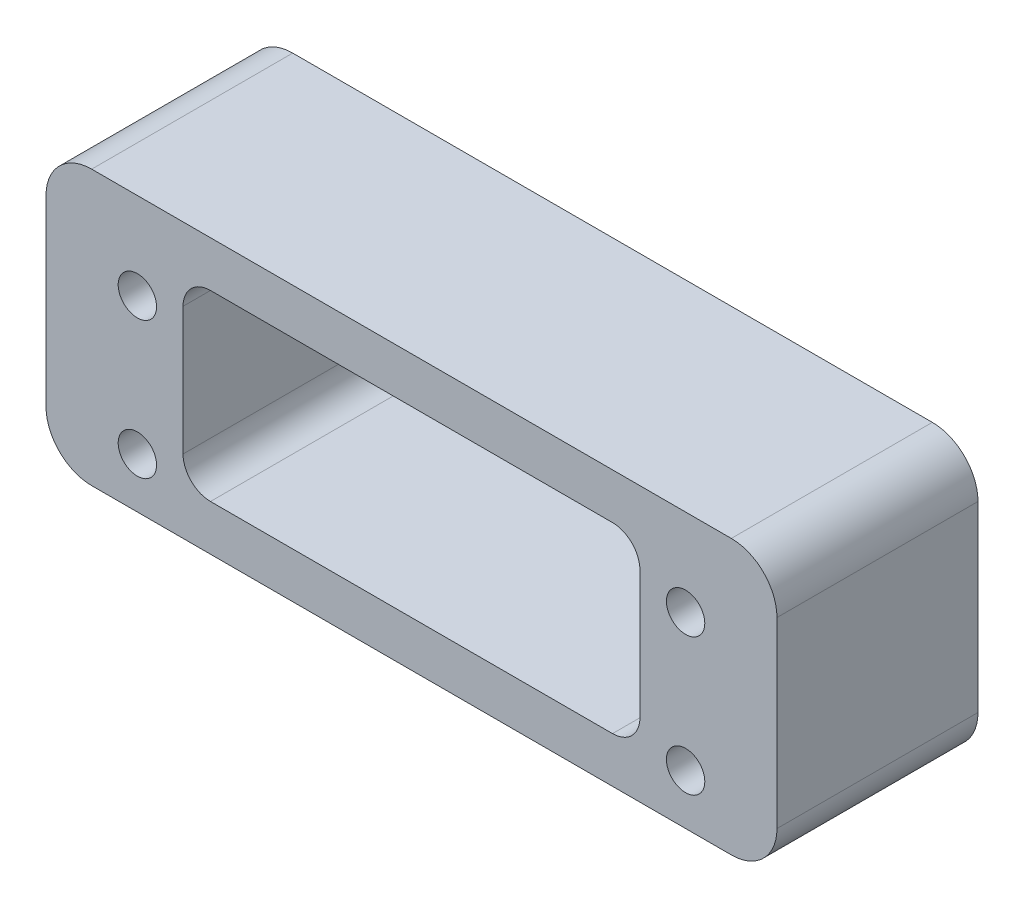
ISO-10303-21;
HEADER;
FILE_DESCRIPTION(('STEP AP214'),'2;1');
FILE_NAME('part.step','',(''),(''),'','','');
FILE_SCHEMA(('AUTOMOTIVE_DESIGN { 1 0 10303 214 1 1 1 1 }'));
ENDSEC;
DATA;
#1=APPLICATION_CONTEXT('core data for automotive mechanical design processes');
#2=APPLICATION_PROTOCOL_DEFINITION('international standard','automotive_design',2000,#1);
#3=PRODUCT_CONTEXT('',#1,'mechanical');
#4=PRODUCT('Part','Part','',(#3));
#5=PRODUCT_RELATED_PRODUCT_CATEGORY('part','',(#4));
#6=PRODUCT_DEFINITION_FORMATION('','',#4);
#7=PRODUCT_DEFINITION_CONTEXT('part definition',#1,'design');
#8=PRODUCT_DEFINITION('design','',#6,#7);
#9=PRODUCT_DEFINITION_SHAPE('','',#8);
#10=(LENGTH_UNIT() NAMED_UNIT(*) SI_UNIT(.MILLI.,.METRE.));
#11=(NAMED_UNIT(*) PLANE_ANGLE_UNIT() SI_UNIT($,.RADIAN.));
#12=(NAMED_UNIT(*) SI_UNIT($,.STERADIAN.) SOLID_ANGLE_UNIT());
#13=UNCERTAINTY_MEASURE_WITH_UNIT(LENGTH_MEASURE(1.E-05),#10,'distance_accuracy_value','');
#14=(GEOMETRIC_REPRESENTATION_CONTEXT(3) GLOBAL_UNCERTAINTY_ASSIGNED_CONTEXT((#13)) GLOBAL_UNIT_ASSIGNED_CONTEXT((#10,
#11,#12)) REPRESENTATION_CONTEXT('',''));
#15=CARTESIAN_POINT('',(0.,0.,0.));
#16=DIRECTION('',(0.,0.,1.));
#17=DIRECTION('',(1.,0.,0.));
#18=AXIS2_PLACEMENT_3D('',#15,#16,#17);
#19=CARTESIAN_POINT('',(40.,15.,11.));
#20=DIRECTION('',(-1.,0.,0.));
#21=DIRECTION('',(0.,-1.,0.));
#22=AXIS2_PLACEMENT_3D('',#19,#20,#21);
#23=PLANE('',#22);
#24=DIRECTION('',(0.,1.,0.));
#25=VECTOR('',#24,1.);
#26=CARTESIAN_POINT('',(40.,15.,11.));
#27=LINE('',#26,#25);
#28=CARTESIAN_POINT('',(40.,-10.,11.));
#29=VERTEX_POINT('',#28);
#30=CARTESIAN_POINT('',(40.,9.99999999999999,11.));
#31=VERTEX_POINT('',#30);
#32=EDGE_CURVE('E166',#29,#31,#27,.T.);
#33=ORIENTED_EDGE('',*,*,#32,.F.);
#34=DIRECTION('',(0.,0.,-1.));
#35=VECTOR('',#34,1.);
#36=CARTESIAN_POINT('',(40.,-10.,11.));
#37=LINE('',#36,#35);
#38=CARTESIAN_POINT('',(40.,-10.,-11.));
#39=VERTEX_POINT('',#38);
#40=EDGE_CURVE('E151',#29,#39,#37,.T.);
#41=ORIENTED_EDGE('',*,*,#40,.T.);
#42=DIRECTION('',(0.,1.,0.));
#43=VECTOR('',#42,1.);
#44=CARTESIAN_POINT('',(40.,15.,-11.));
#45=LINE('',#44,#43);
#46=CARTESIAN_POINT('',(40.,9.99999999999999,-11.));
#47=VERTEX_POINT('',#46);
#48=EDGE_CURVE('E163',#39,#47,#45,.T.);
#49=ORIENTED_EDGE('',*,*,#48,.T.);
#50=DIRECTION('',(0.,0.,-1.));
#51=VECTOR('',#50,1.);
#52=CARTESIAN_POINT('',(40.,9.99999999999999,11.));
#53=LINE('',#52,#51);
#54=EDGE_CURVE('E168',#47,#31,#53,.F.);
#55=ORIENTED_EDGE('',*,*,#54,.T.);
#56=EDGE_LOOP('',(#33,#41,#49,#55));
#57=FACE_BOUND('',#56,.T.);
#58=ADVANCED_FACE('F34',(#57),#23,.F.);
#59=CARTESIAN_POINT('',(-40.,15.,11.));
#60=DIRECTION('',(0.,-1.,0.));
#61=DIRECTION('',(1.,0.,0.));
#62=AXIS2_PLACEMENT_3D('',#59,#60,#61);
#63=PLANE('',#62);
#64=DIRECTION('',(-1.,0.,0.));
#65=VECTOR('',#64,1.);
#66=CARTESIAN_POINT('',(-40.,15.,-11.));
#67=LINE('',#66,#65);
#68=CARTESIAN_POINT('',(35.,15.,-11.));
#69=VERTEX_POINT('',#68);
#70=CARTESIAN_POINT('',(-35.,15.,-11.));
#71=VERTEX_POINT('',#70);
#72=EDGE_CURVE('E172',#69,#71,#67,.T.);
#73=ORIENTED_EDGE('',*,*,#72,.T.);
#74=DIRECTION('',(0.,0.,-1.));
#75=VECTOR('',#74,1.);
#76=CARTESIAN_POINT('',(-35.,15.,11.));
#77=LINE('',#76,#75);
#78=CARTESIAN_POINT('',(-35.,15.,11.));
#79=VERTEX_POINT('',#78);
#80=EDGE_CURVE('E213',#71,#79,#77,.F.);
#81=ORIENTED_EDGE('',*,*,#80,.T.);
#82=DIRECTION('',(-1.,0.,0.));
#83=VECTOR('',#82,1.);
#84=CARTESIAN_POINT('',(-40.,15.,11.));
#85=LINE('',#84,#83);
#86=CARTESIAN_POINT('',(35.,15.,11.));
#87=VERTEX_POINT('',#86);
#88=EDGE_CURVE('E288',#87,#79,#85,.T.);
#89=ORIENTED_EDGE('',*,*,#88,.F.);
#90=DIRECTION('',(0.,0.,-1.));
#91=VECTOR('',#90,1.);
#92=CARTESIAN_POINT('',(35.,15.,11.));
#93=LINE('',#92,#91);
#94=EDGE_CURVE('E210',#87,#69,#93,.T.);
#95=ORIENTED_EDGE('',*,*,#94,.T.);
#96=EDGE_LOOP('',(#73,#81,#89,#95));
#97=FACE_BOUND('',#96,.T.);
#98=ADVANCED_FACE('F312',(#97),#63,.F.);
#99=CARTESIAN_POINT('',(-40.,15.,11.));
#100=DIRECTION('',(1.,0.,0.));
#101=DIRECTION('',(0.,1.,0.));
#102=AXIS2_PLACEMENT_3D('',#99,#100,#101);
#103=PLANE('',#102);
#104=DIRECTION('',(0.,-1.,0.));
#105=VECTOR('',#104,1.);
#106=CARTESIAN_POINT('',(-40.,15.,-11.));
#107=LINE('',#106,#105);
#108=CARTESIAN_POINT('',(-40.,9.99999999999999,-11.));
#109=VERTEX_POINT('',#108);
#110=CARTESIAN_POINT('',(-40.,-10.,-11.));
#111=VERTEX_POINT('',#110);
#112=EDGE_CURVE('E176',#109,#111,#107,.T.);
#113=ORIENTED_EDGE('',*,*,#112,.T.);
#114=DIRECTION('',(0.,0.,-1.));
#115=VECTOR('',#114,1.);
#116=CARTESIAN_POINT('',(-40.,-10.,11.));
#117=LINE('',#116,#115);
#118=CARTESIAN_POINT('',(-40.,-10.,11.));
#119=VERTEX_POINT('',#118);
#120=EDGE_CURVE('E208',#111,#119,#117,.F.);
#121=ORIENTED_EDGE('',*,*,#120,.T.);
#122=DIRECTION('',(0.,-1.,0.));
#123=VECTOR('',#122,1.);
#124=CARTESIAN_POINT('',(-40.,15.,11.));
#125=LINE('',#124,#123);
#126=CARTESIAN_POINT('',(-40.,9.99999999999999,11.));
#127=VERTEX_POINT('',#126);
#128=EDGE_CURVE('E290',#127,#119,#125,.T.);
#129=ORIENTED_EDGE('',*,*,#128,.F.);
#130=DIRECTION('',(0.,0.,-1.));
#131=VECTOR('',#130,1.);
#132=CARTESIAN_POINT('',(-40.,9.99999999999999,11.));
#133=LINE('',#132,#131);
#134=EDGE_CURVE('E205',#127,#109,#133,.T.);
#135=ORIENTED_EDGE('',*,*,#134,.T.);
#136=EDGE_LOOP('',(#113,#121,#129,#135));
#137=FACE_BOUND('',#136,.T.);
#138=ADVANCED_FACE('F305',(#137),#103,.F.);
#139=CARTESIAN_POINT('',(-40.,-15.,11.));
#140=DIRECTION('',(0.,1.,0.));
#141=DIRECTION('',(0.,0.,1.));
#142=AXIS2_PLACEMENT_3D('',#139,#140,#141);
#143=PLANE('',#142);
#144=DIRECTION('',(1.,0.,0.));
#145=VECTOR('',#144,1.);
#146=CARTESIAN_POINT('',(-40.,-15.,-11.));
#147=LINE('',#146,#145);
#148=CARTESIAN_POINT('',(-35.,-15.,-11.));
#149=VERTEX_POINT('',#148);
#150=CARTESIAN_POINT('',(35.,-15.,-11.));
#151=VERTEX_POINT('',#150);
#152=EDGE_CURVE('E187',#149,#151,#147,.T.);
#153=ORIENTED_EDGE('',*,*,#152,.T.);
#154=DIRECTION('',(0.,0.,-1.));
#155=VECTOR('',#154,1.);
#156=CARTESIAN_POINT('',(35.,-15.,11.));
#157=LINE('',#156,#155);
#158=CARTESIAN_POINT('',(35.,-15.,11.));
#159=VERTEX_POINT('',#158);
#160=EDGE_CURVE('E152',#151,#159,#157,.F.);
#161=ORIENTED_EDGE('',*,*,#160,.T.);
#162=DIRECTION('',(1.,0.,0.));
#163=VECTOR('',#162,1.);
#164=CARTESIAN_POINT('',(-40.,-15.,11.));
#165=LINE('',#164,#163);
#166=CARTESIAN_POINT('',(-35.,-15.,11.));
#167=VERTEX_POINT('',#166);
#168=EDGE_CURVE('E182',#167,#159,#165,.T.);
#169=ORIENTED_EDGE('',*,*,#168,.F.);
#170=DIRECTION('',(0.,0.,-1.));
#171=VECTOR('',#170,1.);
#172=CARTESIAN_POINT('',(-35.,-15.,11.));
#173=LINE('',#172,#171);
#174=EDGE_CURVE('E157',#167,#149,#173,.T.);
#175=ORIENTED_EDGE('',*,*,#174,.T.);
#176=EDGE_LOOP('',(#153,#161,#169,#175));
#177=FACE_BOUND('',#176,.T.);
#178=ADVANCED_FACE('F299',(#177),#143,.F.);
#179=CARTESIAN_POINT('',(0.,0.,11.));
#180=DIRECTION('',(0.,0.,1.));
#181=DIRECTION('',(1.,0.,0.));
#182=AXIS2_PLACEMENT_3D('',#179,#180,#181);
#183=PLANE('',#182);
#184=DIRECTION('',(0.,1.,0.));
#185=VECTOR('',#184,1.);
#186=CARTESIAN_POINT('',(25.,10.,11.));
#187=LINE('',#186,#185);
#188=CARTESIAN_POINT('',(25.,-6.99999999999999,11.));
#189=VERTEX_POINT('',#188);
#190=CARTESIAN_POINT('',(25.,7.,11.));
#191=VERTEX_POINT('',#190);
#192=EDGE_CURVE('E252',#189,#191,#187,.T.);
#193=ORIENTED_EDGE('',*,*,#192,.F.);
#194=CARTESIAN_POINT('',(22.,-7.,11.));
#195=DIRECTION('',(0.,0.,1.));
#196=DIRECTION('',(1.,0.,0.));
#197=AXIS2_PLACEMENT_3D('',#194,#195,#196);
#198=CIRCLE('',#197,3.);
#199=CARTESIAN_POINT('',(22.,-10.,11.));
#200=VERTEX_POINT('',#199);
#201=EDGE_CURVE('E42',#189,#200,#198,.F.);
#202=ORIENTED_EDGE('',*,*,#201,.T.);
#203=DIRECTION('',(1.,0.,0.));
#204=VECTOR('',#203,1.);
#205=CARTESIAN_POINT('',(-25.,-10.,11.));
#206=LINE('',#205,#204);
#207=CARTESIAN_POINT('',(-22.,-10.,11.));
#208=VERTEX_POINT('',#207);
#209=EDGE_CURVE('E251',#208,#200,#206,.T.);
#210=ORIENTED_EDGE('',*,*,#209,.F.);
#211=CARTESIAN_POINT('',(-22.,-7.,11.));
#212=DIRECTION('',(0.,0.,1.));
#213=DIRECTION('',(1.,0.,0.));
#214=AXIS2_PLACEMENT_3D('',#211,#212,#213);
#215=CIRCLE('',#214,3.);
#216=CARTESIAN_POINT('',(-25.,-7.,11.));
#217=VERTEX_POINT('',#216);
#218=EDGE_CURVE('E234',#208,#217,#215,.F.);
#219=ORIENTED_EDGE('',*,*,#218,.T.);
#220=DIRECTION('',(0.,-1.,0.));
#221=VECTOR('',#220,1.);
#222=CARTESIAN_POINT('',(-25.,10.,11.));
#223=LINE('',#222,#221);
#224=CARTESIAN_POINT('',(-25.,7.,11.));
#225=VERTEX_POINT('',#224);
#226=EDGE_CURVE('E261',#225,#217,#223,.T.);
#227=ORIENTED_EDGE('',*,*,#226,.F.);
#228=CARTESIAN_POINT('',(-22.,7.,11.));
#229=DIRECTION('',(0.,0.,1.));
#230=DIRECTION('',(1.,0.,0.));
#231=AXIS2_PLACEMENT_3D('',#228,#229,#230);
#232=CIRCLE('',#231,3.);
#233=CARTESIAN_POINT('',(-22.,10.,11.));
#234=VERTEX_POINT('',#233);
#235=EDGE_CURVE('E238',#225,#234,#232,.F.);
#236=ORIENTED_EDGE('',*,*,#235,.T.);
#237=DIRECTION('',(-1.,0.,0.));
#238=VECTOR('',#237,1.);
#239=CARTESIAN_POINT('',(-25.,10.,11.));
#240=LINE('',#239,#238);
#241=CARTESIAN_POINT('',(22.,10.,11.));
#242=VERTEX_POINT('',#241);
#243=EDGE_CURVE('E279',#242,#234,#240,.T.);
#244=ORIENTED_EDGE('',*,*,#243,.F.);
#245=CARTESIAN_POINT('',(22.,7.,11.));
#246=DIRECTION('',(0.,0.,1.));
#247=DIRECTION('',(1.,0.,0.));
#248=AXIS2_PLACEMENT_3D('',#245,#246,#247);
#249=CIRCLE('',#248,3.);
#250=EDGE_CURVE('E242',#242,#191,#249,.F.);
#251=ORIENTED_EDGE('',*,*,#250,.T.);
#252=EDGE_LOOP('',(#193,#202,#210,#219,#227,#236,#244,#251));
#253=FACE_BOUND('',#252,.T.);
#254=CARTESIAN_POINT('',(-30.,-9.49999999999967,11.));
#255=DIRECTION('',(0.,0.,1.));
#256=DIRECTION('',(1.,0.,0.));
#257=AXIS2_PLACEMENT_3D('',#254,#255,#256);
#258=CIRCLE('',#257,2.1);
#259=CARTESIAN_POINT('',(-27.9,-9.49999999999967,11.));
#260=VERTEX_POINT('',#259);
#261=EDGE_CURVE('E271',#260,#260,#258,.T.);
#262=ORIENTED_EDGE('',*,*,#261,.F.);
#263=EDGE_LOOP('',(#262));
#264=FACE_BOUND('',#263,.T.);
#265=CARTESIAN_POINT('',(30.,-9.49999999999967,11.));
#266=DIRECTION('',(0.,0.,1.));
#267=DIRECTION('',(1.,0.,0.));
#268=AXIS2_PLACEMENT_3D('',#265,#266,#267);
#269=CIRCLE('',#268,2.1);
#270=CARTESIAN_POINT('',(32.1,-9.49999999999967,11.));
#271=VERTEX_POINT('',#270);
#272=EDGE_CURVE('E514',#271,#271,#269,.T.);
#273=ORIENTED_EDGE('',*,*,#272,.F.);
#274=EDGE_LOOP('',(#273));
#275=FACE_BOUND('',#274,.T.);
#276=CARTESIAN_POINT('',(30.,5.50000000000033,11.));
#277=DIRECTION('',(0.,0.,1.));
#278=DIRECTION('',(1.,0.,0.));
#279=AXIS2_PLACEMENT_3D('',#276,#277,#278);
#280=CIRCLE('',#279,2.1);
#281=CARTESIAN_POINT('',(32.1,5.50000000000033,11.));
#282=VERTEX_POINT('',#281);
#283=EDGE_CURVE('E508',#282,#282,#280,.T.);
#284=ORIENTED_EDGE('',*,*,#283,.F.);
#285=EDGE_LOOP('',(#284));
#286=FACE_BOUND('',#285,.T.);
#287=CARTESIAN_POINT('',(-30.,5.50000000000033,11.));
#288=DIRECTION('',(0.,0.,1.));
#289=DIRECTION('',(1.,0.,0.));
#290=AXIS2_PLACEMENT_3D('',#287,#288,#289);
#291=CIRCLE('',#290,2.1);
#292=CARTESIAN_POINT('',(-27.9,5.50000000000033,11.));
#293=VERTEX_POINT('',#292);
#294=EDGE_CURVE('E179',#293,#293,#291,.T.);
#295=ORIENTED_EDGE('',*,*,#294,.F.);
#296=EDGE_LOOP('',(#295));
#297=FACE_BOUND('',#296,.T.);
#298=ORIENTED_EDGE('',*,*,#168,.T.);
#299=CARTESIAN_POINT('',(35.,-10.,11.));
#300=DIRECTION('',(0.,0.,1.));
#301=DIRECTION('',(1.,0.,0.));
#302=AXIS2_PLACEMENT_3D('',#299,#300,#301);
#303=CIRCLE('',#302,5.);
#304=EDGE_CURVE('E203',#159,#29,#303,.T.);
#305=ORIENTED_EDGE('',*,*,#304,.T.);
#306=ORIENTED_EDGE('',*,*,#32,.T.);
#307=CARTESIAN_POINT('',(35.,9.99999999999999,11.));
#308=DIRECTION('',(0.,0.,1.));
#309=DIRECTION('',(1.,0.,0.));
#310=AXIS2_PLACEMENT_3D('',#307,#308,#309);
#311=CIRCLE('',#310,5.);
#312=EDGE_CURVE('E197',#31,#87,#311,.T.);
#313=ORIENTED_EDGE('',*,*,#312,.T.);
#314=ORIENTED_EDGE('',*,*,#88,.T.);
#315=CARTESIAN_POINT('',(-35.,9.99999999999999,11.));
#316=DIRECTION('',(0.,0.,1.));
#317=DIRECTION('',(1.,0.,0.));
#318=AXIS2_PLACEMENT_3D('',#315,#316,#317);
#319=CIRCLE('',#318,5.);
#320=EDGE_CURVE('E199',#79,#127,#319,.T.);
#321=ORIENTED_EDGE('',*,*,#320,.T.);
#322=ORIENTED_EDGE('',*,*,#128,.T.);
#323=CARTESIAN_POINT('',(-35.,-10.,11.));
#324=DIRECTION('',(0.,0.,1.));
#325=DIRECTION('',(1.,0.,0.));
#326=AXIS2_PLACEMENT_3D('',#323,#324,#325);
#327=CIRCLE('',#326,5.);
#328=EDGE_CURVE('E201',#119,#167,#327,.T.);
#329=ORIENTED_EDGE('',*,*,#328,.T.);
#330=EDGE_LOOP('',(#298,#305,#306,#313,#314,#321,#322,#329));
#331=FACE_BOUND('',#330,.T.);
#332=ADVANCED_FACE('F249',(#253,#264,#275,#286,#297,#331),#183,.T.);
#333=CARTESIAN_POINT('',(0.,0.,-11.));
#334=DIRECTION('',(0.,0.,1.));
#335=DIRECTION('',(1.,0.,0.));
#336=AXIS2_PLACEMENT_3D('',#333,#334,#335);
#337=PLANE('',#336);
#338=DIRECTION('',(0.,-1.,0.));
#339=VECTOR('',#338,1.);
#340=CARTESIAN_POINT('',(-25.,10.,-11.));
#341=LINE('',#340,#339);
#342=CARTESIAN_POINT('',(-25.,7.,-11.));
#343=VERTEX_POINT('',#342);
#344=CARTESIAN_POINT('',(-25.,-7.,-11.));
#345=VERTEX_POINT('',#344);
#346=EDGE_CURVE('E268',#343,#345,#341,.T.);
#347=ORIENTED_EDGE('',*,*,#346,.T.);
#348=CARTESIAN_POINT('',(-22.,-7.,-11.));
#349=DIRECTION('',(0.,0.,1.));
#350=DIRECTION('',(1.,0.,0.));
#351=AXIS2_PLACEMENT_3D('',#348,#349,#350);
#352=CIRCLE('',#351,3.);
#353=CARTESIAN_POINT('',(-22.,-10.,-11.));
#354=VERTEX_POINT('',#353);
#355=EDGE_CURVE('E236',#345,#354,#352,.T.);
#356=ORIENTED_EDGE('',*,*,#355,.T.);
#357=DIRECTION('',(1.,0.,0.));
#358=VECTOR('',#357,1.);
#359=CARTESIAN_POINT('',(-25.,-10.,-11.));
#360=LINE('',#359,#358);
#361=CARTESIAN_POINT('',(22.,-10.,-11.));
#362=VERTEX_POINT('',#361);
#363=EDGE_CURVE('E276',#354,#362,#360,.T.);
#364=ORIENTED_EDGE('',*,*,#363,.T.);
#365=CARTESIAN_POINT('',(22.,-7.,-11.));
#366=DIRECTION('',(0.,0.,1.));
#367=DIRECTION('',(1.,0.,0.));
#368=AXIS2_PLACEMENT_3D('',#365,#366,#367);
#369=CIRCLE('',#368,3.);
#370=CARTESIAN_POINT('',(25.,-6.99999999999999,-11.));
#371=VERTEX_POINT('',#370);
#372=EDGE_CURVE('E11',#362,#371,#369,.T.);
#373=ORIENTED_EDGE('',*,*,#372,.T.);
#374=DIRECTION('',(0.,1.,0.));
#375=VECTOR('',#374,1.);
#376=CARTESIAN_POINT('',(25.,10.,-11.));
#377=LINE('',#376,#375);
#378=CARTESIAN_POINT('',(25.,7.,-11.));
#379=VERTEX_POINT('',#378);
#380=EDGE_CURVE('E260',#371,#379,#377,.T.);
#381=ORIENTED_EDGE('',*,*,#380,.T.);
#382=CARTESIAN_POINT('',(22.,7.,-11.));
#383=DIRECTION('',(0.,0.,1.));
#384=DIRECTION('',(1.,0.,0.));
#385=AXIS2_PLACEMENT_3D('',#382,#383,#384);
#386=CIRCLE('',#385,3.);
#387=CARTESIAN_POINT('',(22.,10.,-11.));
#388=VERTEX_POINT('',#387);
#389=EDGE_CURVE('E244',#379,#388,#386,.T.);
#390=ORIENTED_EDGE('',*,*,#389,.T.);
#391=DIRECTION('',(-1.,0.,0.));
#392=VECTOR('',#391,1.);
#393=CARTESIAN_POINT('',(-25.,10.,-11.));
#394=LINE('',#393,#392);
#395=CARTESIAN_POINT('',(-22.,10.,-11.));
#396=VERTEX_POINT('',#395);
#397=EDGE_CURVE('E265',#388,#396,#394,.T.);
#398=ORIENTED_EDGE('',*,*,#397,.T.);
#399=CARTESIAN_POINT('',(-22.,7.,-11.));
#400=DIRECTION('',(0.,0.,1.));
#401=DIRECTION('',(1.,0.,0.));
#402=AXIS2_PLACEMENT_3D('',#399,#400,#401);
#403=CIRCLE('',#402,3.);
#404=EDGE_CURVE('E240',#396,#343,#403,.T.);
#405=ORIENTED_EDGE('',*,*,#404,.T.);
#406=EDGE_LOOP('',(#347,#356,#364,#373,#381,#390,#398,#405));
#407=FACE_BOUND('',#406,.T.);
#408=CARTESIAN_POINT('',(-30.,-9.49999999999967,-11.));
#409=DIRECTION('',(0.,0.,1.));
#410=DIRECTION('',(1.,0.,0.));
#411=AXIS2_PLACEMENT_3D('',#408,#409,#410);
#412=CIRCLE('',#411,2.1);
#413=CARTESIAN_POINT('',(-27.9,-9.49999999999967,-11.));
#414=VERTEX_POINT('',#413);
#415=EDGE_CURVE('E496',#414,#414,#412,.T.);
#416=ORIENTED_EDGE('',*,*,#415,.T.);
#417=EDGE_LOOP('',(#416));
#418=FACE_BOUND('',#417,.T.);
#419=CARTESIAN_POINT('',(30.,-9.49999999999967,-11.));
#420=DIRECTION('',(0.,0.,1.));
#421=DIRECTION('',(1.,0.,0.));
#422=AXIS2_PLACEMENT_3D('',#419,#420,#421);
#423=CIRCLE('',#422,2.1);
#424=CARTESIAN_POINT('',(32.1,-9.49999999999967,-11.));
#425=VERTEX_POINT('',#424);
#426=EDGE_CURVE('E500',#425,#425,#423,.T.);
#427=ORIENTED_EDGE('',*,*,#426,.T.);
#428=EDGE_LOOP('',(#427));
#429=FACE_BOUND('',#428,.T.);
#430=CARTESIAN_POINT('',(30.,5.50000000000033,-11.));
#431=DIRECTION('',(0.,0.,1.));
#432=DIRECTION('',(1.,0.,0.));
#433=AXIS2_PLACEMENT_3D('',#430,#431,#432);
#434=CIRCLE('',#433,2.1);
#435=CARTESIAN_POINT('',(32.1,5.50000000000033,-11.));
#436=VERTEX_POINT('',#435);
#437=EDGE_CURVE('E286',#436,#436,#434,.T.);
#438=ORIENTED_EDGE('',*,*,#437,.T.);
#439=EDGE_LOOP('',(#438));
#440=FACE_BOUND('',#439,.T.);
#441=CARTESIAN_POINT('',(-30.,5.50000000000033,-11.));
#442=DIRECTION('',(0.,0.,1.));
#443=DIRECTION('',(1.,0.,0.));
#444=AXIS2_PLACEMENT_3D('',#441,#442,#443);
#445=CIRCLE('',#444,2.1);
#446=CARTESIAN_POINT('',(-27.9,5.50000000000033,-11.));
#447=VERTEX_POINT('',#446);
#448=EDGE_CURVE('E173',#447,#447,#445,.T.);
#449=ORIENTED_EDGE('',*,*,#448,.T.);
#450=EDGE_LOOP('',(#449));
#451=FACE_BOUND('',#450,.T.);
#452=ORIENTED_EDGE('',*,*,#48,.F.);
#453=CARTESIAN_POINT('',(35.,-10.,-11.));
#454=DIRECTION('',(0.,0.,1.));
#455=DIRECTION('',(1.,0.,0.));
#456=AXIS2_PLACEMENT_3D('',#453,#454,#455);
#457=CIRCLE('',#456,5.);
#458=EDGE_CURVE('E147',#39,#151,#457,.F.);
#459=ORIENTED_EDGE('',*,*,#458,.T.);
#460=ORIENTED_EDGE('',*,*,#152,.F.);
#461=CARTESIAN_POINT('',(-35.,-10.,-11.));
#462=DIRECTION('',(0.,0.,1.));
#463=DIRECTION('',(1.,0.,0.));
#464=AXIS2_PLACEMENT_3D('',#461,#462,#463);
#465=CIRCLE('',#464,5.);
#466=EDGE_CURVE('E158',#149,#111,#465,.F.);
#467=ORIENTED_EDGE('',*,*,#466,.T.);
#468=ORIENTED_EDGE('',*,*,#112,.F.);
#469=CARTESIAN_POINT('',(-35.,9.99999999999999,-11.));
#470=DIRECTION('',(0.,0.,1.));
#471=DIRECTION('',(1.,0.,0.));
#472=AXIS2_PLACEMENT_3D('',#469,#470,#471);
#473=CIRCLE('',#472,5.);
#474=EDGE_CURVE('E191',#109,#71,#473,.F.);
#475=ORIENTED_EDGE('',*,*,#474,.T.);
#476=ORIENTED_EDGE('',*,*,#72,.F.);
#477=CARTESIAN_POINT('',(35.,9.99999999999999,-11.));
#478=DIRECTION('',(0.,0.,1.));
#479=DIRECTION('',(1.,0.,0.));
#480=AXIS2_PLACEMENT_3D('',#477,#478,#479);
#481=CIRCLE('',#480,5.);
#482=EDGE_CURVE('E167',#69,#47,#481,.F.);
#483=ORIENTED_EDGE('',*,*,#482,.T.);
#484=EDGE_LOOP('',(#452,#459,#460,#467,#468,#475,#476,#483));
#485=FACE_BOUND('',#484,.T.);
#486=ADVANCED_FACE('F170',(#407,#418,#429,#440,#451,#485),#337,.F.);
#487=CARTESIAN_POINT('',(35.,-10.,11.));
#488=DIRECTION('',(0.,0.,-1.));
#489=DIRECTION('',(-1.,0.,0.));
#490=AXIS2_PLACEMENT_3D('',#487,#488,#489);
#491=CYLINDRICAL_SURFACE('',#490,5.);
#492=ORIENTED_EDGE('',*,*,#304,.F.);
#493=ORIENTED_EDGE('',*,*,#160,.F.);
#494=ORIENTED_EDGE('',*,*,#458,.F.);
#495=ORIENTED_EDGE('',*,*,#40,.F.);
#496=EDGE_LOOP('',(#492,#493,#494,#495));
#497=FACE_BOUND('',#496,.T.);
#498=ADVANCED_FACE('F150',(#497),#491,.T.);
#499=CARTESIAN_POINT('',(-35.,-10.,11.));
#500=DIRECTION('',(0.,0.,-1.));
#501=DIRECTION('',(-1.,0.,0.));
#502=AXIS2_PLACEMENT_3D('',#499,#500,#501);
#503=CYLINDRICAL_SURFACE('',#502,5.);
#504=ORIENTED_EDGE('',*,*,#328,.F.);
#505=ORIENTED_EDGE('',*,*,#120,.F.);
#506=ORIENTED_EDGE('',*,*,#466,.F.);
#507=ORIENTED_EDGE('',*,*,#174,.F.);
#508=EDGE_LOOP('',(#504,#505,#506,#507));
#509=FACE_BOUND('',#508,.T.);
#510=ADVANCED_FACE('F301',(#509),#503,.T.);
#511=CARTESIAN_POINT('',(-35.,9.99999999999999,11.));
#512=DIRECTION('',(0.,0.,-1.));
#513=DIRECTION('',(-1.,0.,0.));
#514=AXIS2_PLACEMENT_3D('',#511,#512,#513);
#515=CYLINDRICAL_SURFACE('',#514,5.);
#516=ORIENTED_EDGE('',*,*,#320,.F.);
#517=ORIENTED_EDGE('',*,*,#80,.F.);
#518=ORIENTED_EDGE('',*,*,#474,.F.);
#519=ORIENTED_EDGE('',*,*,#134,.F.);
#520=EDGE_LOOP('',(#516,#517,#518,#519));
#521=FACE_BOUND('',#520,.T.);
#522=ADVANCED_FACE('F309',(#521),#515,.T.);
#523=CARTESIAN_POINT('',(35.,9.99999999999999,11.));
#524=DIRECTION('',(0.,0.,-1.));
#525=DIRECTION('',(-1.,0.,0.));
#526=AXIS2_PLACEMENT_3D('',#523,#524,#525);
#527=CYLINDRICAL_SURFACE('',#526,5.);
#528=ORIENTED_EDGE('',*,*,#312,.F.);
#529=ORIENTED_EDGE('',*,*,#54,.F.);
#530=ORIENTED_EDGE('',*,*,#482,.F.);
#531=ORIENTED_EDGE('',*,*,#94,.F.);
#532=EDGE_LOOP('',(#528,#529,#530,#531));
#533=FACE_BOUND('',#532,.T.);
#534=ADVANCED_FACE('F317',(#533),#527,.T.);
#535=CARTESIAN_POINT('',(-30.,5.50000000000033,-11.));
#536=DIRECTION('',(0.,0.,1.));
#537=DIRECTION('',(1.,0.,0.));
#538=AXIS2_PLACEMENT_3D('',#535,#536,#537);
#539=CYLINDRICAL_SURFACE('',#538,2.1);
#540=ORIENTED_EDGE('',*,*,#448,.F.);
#541=EDGE_LOOP('',(#540));
#542=FACE_BOUND('',#541,.T.);
#543=ORIENTED_EDGE('',*,*,#294,.T.);
#544=EDGE_LOOP('',(#543));
#545=FACE_BOUND('',#544,.T.);
#546=ADVANCED_FACE('F319',(#542,#545),#539,.F.);
#547=CARTESIAN_POINT('',(30.,5.50000000000033,-11.));
#548=DIRECTION('',(0.,0.,1.));
#549=DIRECTION('',(1.,0.,0.));
#550=AXIS2_PLACEMENT_3D('',#547,#548,#549);
#551=CYLINDRICAL_SURFACE('',#550,2.1);
#552=ORIENTED_EDGE('',*,*,#437,.F.);
#553=EDGE_LOOP('',(#552));
#554=FACE_BOUND('',#553,.T.);
#555=ORIENTED_EDGE('',*,*,#283,.T.);
#556=EDGE_LOOP('',(#555));
#557=FACE_BOUND('',#556,.T.);
#558=ADVANCED_FACE('F325',(#554,#557),#551,.F.);
#559=CARTESIAN_POINT('',(30.,-9.49999999999967,-11.));
#560=DIRECTION('',(0.,0.,1.));
#561=DIRECTION('',(1.,0.,0.));
#562=AXIS2_PLACEMENT_3D('',#559,#560,#561);
#563=CYLINDRICAL_SURFACE('',#562,2.1);
#564=ORIENTED_EDGE('',*,*,#426,.F.);
#565=EDGE_LOOP('',(#564));
#566=FACE_BOUND('',#565,.T.);
#567=ORIENTED_EDGE('',*,*,#272,.T.);
#568=EDGE_LOOP('',(#567));
#569=FACE_BOUND('',#568,.T.);
#570=ADVANCED_FACE('F369',(#566,#569),#563,.F.);
#571=CARTESIAN_POINT('',(-30.,-9.49999999999967,-11.));
#572=DIRECTION('',(0.,0.,1.));
#573=DIRECTION('',(1.,0.,0.));
#574=AXIS2_PLACEMENT_3D('',#571,#572,#573);
#575=CYLINDRICAL_SURFACE('',#574,2.1);
#576=ORIENTED_EDGE('',*,*,#415,.F.);
#577=EDGE_LOOP('',(#576));
#578=FACE_BOUND('',#577,.T.);
#579=ORIENTED_EDGE('',*,*,#261,.T.);
#580=EDGE_LOOP('',(#579));
#581=FACE_BOUND('',#580,.T.);
#582=ADVANCED_FACE('F379',(#578,#581),#575,.F.);
#583=CARTESIAN_POINT('',(25.,10.,-11.));
#584=DIRECTION('',(1.,0.,0.));
#585=DIRECTION('',(0.,1.,0.));
#586=AXIS2_PLACEMENT_3D('',#583,#584,#585);
#587=PLANE('',#586);
#588=ORIENTED_EDGE('',*,*,#192,.T.);
#589=DIRECTION('',(0.,0.,1.));
#590=VECTOR('',#589,1.);
#591=CARTESIAN_POINT('',(25.,7.,-11.));
#592=LINE('',#591,#590);
#593=EDGE_CURVE('E49',#191,#379,#592,.F.);
#594=ORIENTED_EDGE('',*,*,#593,.T.);
#595=ORIENTED_EDGE('',*,*,#380,.F.);
#596=DIRECTION('',(0.,0.,1.));
#597=VECTOR('',#596,1.);
#598=CARTESIAN_POINT('',(25.,-6.99999999999999,11.));
#599=LINE('',#598,#597);
#600=EDGE_CURVE('E230',#371,#189,#599,.T.);
#601=ORIENTED_EDGE('',*,*,#600,.T.);
#602=EDGE_LOOP('',(#588,#594,#595,#601));
#603=FACE_BOUND('',#602,.T.);
#604=ADVANCED_FACE('F263',(#603),#587,.F.);
#605=CARTESIAN_POINT('',(-25.,-10.,-11.));
#606=DIRECTION('',(0.,-1.,0.));
#607=DIRECTION('',(0.,0.,-1.));
#608=AXIS2_PLACEMENT_3D('',#605,#606,#607);
#609=PLANE('',#608);
#610=ORIENTED_EDGE('',*,*,#363,.F.);
#611=DIRECTION('',(0.,0.,1.));
#612=VECTOR('',#611,1.);
#613=CARTESIAN_POINT('',(-22.,-10.,11.));
#614=LINE('',#613,#612);
#615=EDGE_CURVE('E217',#354,#208,#614,.T.);
#616=ORIENTED_EDGE('',*,*,#615,.T.);
#617=ORIENTED_EDGE('',*,*,#209,.T.);
#618=DIRECTION('',(0.,0.,1.));
#619=VECTOR('',#618,1.);
#620=CARTESIAN_POINT('',(22.,-10.,-11.));
#621=LINE('',#620,#619);
#622=EDGE_CURVE('E215',#200,#362,#621,.F.);
#623=ORIENTED_EDGE('',*,*,#622,.T.);
#624=EDGE_LOOP('',(#610,#616,#617,#623));
#625=FACE_BOUND('',#624,.T.);
#626=ADVANCED_FACE('F258',(#625),#609,.F.);
#627=CARTESIAN_POINT('',(-25.,10.,-11.));
#628=DIRECTION('',(-1.,0.,0.));
#629=DIRECTION('',(0.,-1.,0.));
#630=AXIS2_PLACEMENT_3D('',#627,#628,#629);
#631=PLANE('',#630);
#632=ORIENTED_EDGE('',*,*,#226,.T.);
#633=DIRECTION('',(0.,0.,1.));
#634=VECTOR('',#633,1.);
#635=CARTESIAN_POINT('',(-25.,-7.,-11.));
#636=LINE('',#635,#634);
#637=EDGE_CURVE('E223',#217,#345,#636,.F.);
#638=ORIENTED_EDGE('',*,*,#637,.T.);
#639=ORIENTED_EDGE('',*,*,#346,.F.);
#640=DIRECTION('',(0.,0.,1.));
#641=VECTOR('',#640,1.);
#642=CARTESIAN_POINT('',(-25.,7.,11.));
#643=LINE('',#642,#641);
#644=EDGE_CURVE('E220',#343,#225,#643,.T.);
#645=ORIENTED_EDGE('',*,*,#644,.T.);
#646=EDGE_LOOP('',(#632,#638,#639,#645));
#647=FACE_BOUND('',#646,.T.);
#648=ADVANCED_FACE('F424',(#647),#631,.F.);
#649=CARTESIAN_POINT('',(-25.,10.,-11.));
#650=DIRECTION('',(0.,1.,0.));
#651=DIRECTION('',(0.,0.,1.));
#652=AXIS2_PLACEMENT_3D('',#649,#650,#651);
#653=PLANE('',#652);
#654=ORIENTED_EDGE('',*,*,#243,.T.);
#655=DIRECTION('',(0.,0.,1.));
#656=VECTOR('',#655,1.);
#657=CARTESIAN_POINT('',(-22.,10.,-11.));
#658=LINE('',#657,#656);
#659=EDGE_CURVE('E228',#234,#396,#658,.F.);
#660=ORIENTED_EDGE('',*,*,#659,.T.);
#661=ORIENTED_EDGE('',*,*,#397,.F.);
#662=DIRECTION('',(0.,0.,1.));
#663=VECTOR('',#662,1.);
#664=CARTESIAN_POINT('',(22.,10.,11.));
#665=LINE('',#664,#663);
#666=EDGE_CURVE('E225',#388,#242,#665,.T.);
#667=ORIENTED_EDGE('',*,*,#666,.T.);
#668=EDGE_LOOP('',(#654,#660,#661,#667));
#669=FACE_BOUND('',#668,.T.);
#670=ADVANCED_FACE('F433',(#669),#653,.F.);
#671=CARTESIAN_POINT('',(-22.,-7.,-11.));
#672=DIRECTION('',(0.,0.,-1.));
#673=DIRECTION('',(-1.,0.,0.));
#674=AXIS2_PLACEMENT_3D('',#671,#672,#673);
#675=CYLINDRICAL_SURFACE('',#674,3.);
#676=ORIENTED_EDGE('',*,*,#355,.F.);
#677=ORIENTED_EDGE('',*,*,#637,.F.);
#678=ORIENTED_EDGE('',*,*,#218,.F.);
#679=ORIENTED_EDGE('',*,*,#615,.F.);
#680=EDGE_LOOP('',(#676,#677,#678,#679));
#681=FACE_BOUND('',#680,.T.);
#682=ADVANCED_FACE('F443',(#681),#675,.F.);
#683=CARTESIAN_POINT('',(-22.,7.,-11.));
#684=DIRECTION('',(0.,0.,-1.));
#685=DIRECTION('',(-1.,0.,0.));
#686=AXIS2_PLACEMENT_3D('',#683,#684,#685);
#687=CYLINDRICAL_SURFACE('',#686,3.);
#688=ORIENTED_EDGE('',*,*,#404,.F.);
#689=ORIENTED_EDGE('',*,*,#659,.F.);
#690=ORIENTED_EDGE('',*,*,#235,.F.);
#691=ORIENTED_EDGE('',*,*,#644,.F.);
#692=EDGE_LOOP('',(#688,#689,#690,#691));
#693=FACE_BOUND('',#692,.T.);
#694=ADVANCED_FACE('F453',(#693),#687,.F.);
#695=CARTESIAN_POINT('',(22.,7.,-11.));
#696=DIRECTION('',(0.,0.,-1.));
#697=DIRECTION('',(-1.,0.,0.));
#698=AXIS2_PLACEMENT_3D('',#695,#696,#697);
#699=CYLINDRICAL_SURFACE('',#698,3.);
#700=ORIENTED_EDGE('',*,*,#389,.F.);
#701=ORIENTED_EDGE('',*,*,#593,.F.);
#702=ORIENTED_EDGE('',*,*,#250,.F.);
#703=ORIENTED_EDGE('',*,*,#666,.F.);
#704=EDGE_LOOP('',(#700,#701,#702,#703));
#705=FACE_BOUND('',#704,.T.);
#706=ADVANCED_FACE('F462',(#705),#699,.F.);
#707=CARTESIAN_POINT('',(22.,-7.,-11.));
#708=DIRECTION('',(0.,0.,-1.));
#709=DIRECTION('',(-1.,0.,0.));
#710=AXIS2_PLACEMENT_3D('',#707,#708,#709);
#711=CYLINDRICAL_SURFACE('',#710,3.);
#712=ORIENTED_EDGE('',*,*,#372,.F.);
#713=ORIENTED_EDGE('',*,*,#622,.F.);
#714=ORIENTED_EDGE('',*,*,#201,.F.);
#715=ORIENTED_EDGE('',*,*,#600,.F.);
#716=EDGE_LOOP('',(#712,#713,#714,#715));
#717=FACE_BOUND('',#716,.T.);
#718=ADVANCED_FACE('F36',(#717),#711,.F.);
#719=CLOSED_SHELL('',(#58,#98,#138,#178,#332,#486,#498,#510,#522,#534,#546,#558,#570,#582,#604,
#626,#648,#670,#682,#694,#706,#718));
#720=MANIFOLD_SOLID_BREP('B2',#719);
#721=ADVANCED_BREP_SHAPE_REPRESENTATION('',(#18,#720),#14);
#722=SHAPE_DEFINITION_REPRESENTATION(#9,#721);
ENDSEC;
END-ISO-10303-21;
